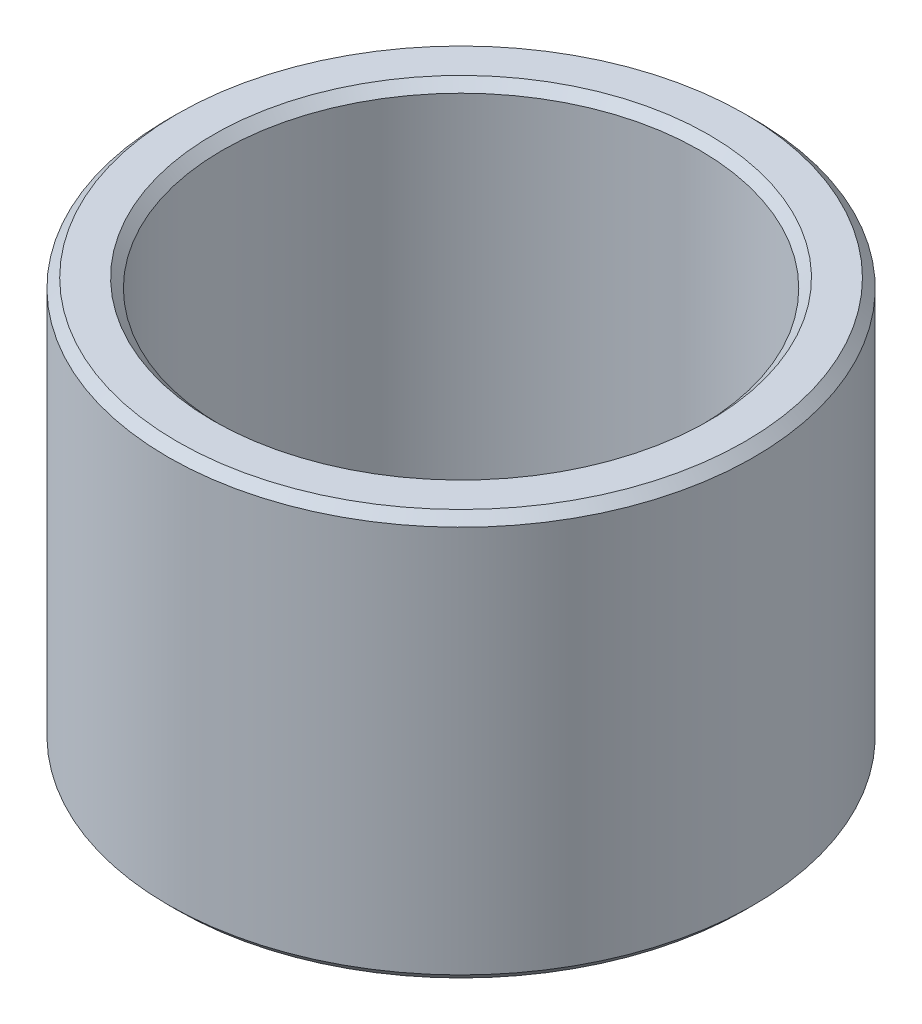
ISO-10303-21;
HEADER;
FILE_DESCRIPTION(('STEP AP214'),'2;1');
FILE_NAME('part.step','',(''),(''),'','','');
FILE_SCHEMA(('AUTOMOTIVE_DESIGN { 1 0 10303 214 1 1 1 1 }'));
ENDSEC;
DATA;
#1=APPLICATION_CONTEXT('core data for automotive mechanical design processes');
#2=APPLICATION_PROTOCOL_DEFINITION('international standard','automotive_design',2000,#1);
#3=PRODUCT_CONTEXT('',#1,'mechanical');
#4=PRODUCT('Part','Part','',(#3));
#5=PRODUCT_RELATED_PRODUCT_CATEGORY('part','',(#4));
#6=PRODUCT_DEFINITION_FORMATION('','',#4);
#7=PRODUCT_DEFINITION_CONTEXT('part definition',#1,'design');
#8=PRODUCT_DEFINITION('design','',#6,#7);
#9=PRODUCT_DEFINITION_SHAPE('','',#8);
#10=(LENGTH_UNIT() NAMED_UNIT(*) SI_UNIT(.MILLI.,.METRE.));
#11=(NAMED_UNIT(*) PLANE_ANGLE_UNIT() SI_UNIT($,.RADIAN.));
#12=(NAMED_UNIT(*) SI_UNIT($,.STERADIAN.) SOLID_ANGLE_UNIT());
#13=UNCERTAINTY_MEASURE_WITH_UNIT(LENGTH_MEASURE(1.E-05),#10,'distance_accuracy_value','');
#14=(GEOMETRIC_REPRESENTATION_CONTEXT(3) GLOBAL_UNCERTAINTY_ASSIGNED_CONTEXT((#13)) GLOBAL_UNIT_ASSIGNED_CONTEXT((#10,
#11,#12)) REPRESENTATION_CONTEXT('',''));
#15=CARTESIAN_POINT('',(0.,0.,0.));
#16=DIRECTION('',(0.,0.,1.));
#17=DIRECTION('',(1.,0.,0.));
#18=AXIS2_PLACEMENT_3D('',#15,#16,#17);
#19=CARTESIAN_POINT('',(0.,55.4194008479267,0.));
#20=DIRECTION('',(0.,-1.,0.));
#21=DIRECTION('',(0.,0.,-1.));
#22=AXIS2_PLACEMENT_3D('',#19,#20,#21);
#23=CYLINDRICAL_SURFACE('',#22,40.);
#24=CARTESIAN_POINT('',(0.,1.23169464694375,0.));
#25=DIRECTION('',(0.,1.,0.));
#26=DIRECTION('',(0.,0.,1.));
#27=AXIS2_PLACEMENT_3D('',#24,#25,#26);
#28=CIRCLE('',#27,40.);
#29=CARTESIAN_POINT('',(0.,1.23169464694375,40.));
#30=VERTEX_POINT('',#29);
#31=EDGE_CURVE('E10',#30,#30,#28,.T.);
#32=ORIENTED_EDGE('',*,*,#31,.T.);
#33=EDGE_LOOP('',(#32));
#34=FACE_BOUND('',#33,.T.);
#35=CARTESIAN_POINT('',(0.,54.1877062009829,0.));
#36=DIRECTION('',(0.,1.,0.));
#37=DIRECTION('',(0.,0.,1.));
#38=AXIS2_PLACEMENT_3D('',#35,#36,#37);
#39=CIRCLE('',#38,40.);
#40=CARTESIAN_POINT('',(0.,54.1877062009829,40.));
#41=VERTEX_POINT('',#40);
#42=EDGE_CURVE('E50',#41,#41,#39,.F.);
#43=ORIENTED_EDGE('',*,*,#42,.T.);
#44=EDGE_LOOP('',(#43));
#45=FACE_BOUND('',#44,.T.);
#46=ADVANCED_FACE('F39',(#34,#45),#23,.T.);
#47=CARTESIAN_POINT('',(0.,55.4194008479267,0.));
#48=DIRECTION('',(0.,1.,0.));
#49=DIRECTION('',(0.,0.,1.));
#50=AXIS2_PLACEMENT_3D('',#47,#48,#49);
#51=PLANE('',#50);
#52=CARTESIAN_POINT('',(0.,55.4194008479267,0.));
#53=DIRECTION('',(0.,1.,0.));
#54=DIRECTION('',(0.,0.,1.));
#55=AXIS2_PLACEMENT_3D('',#52,#53,#54);
#56=CIRCLE('',#55,33.8482485564176);
#57=CARTESIAN_POINT('',(0.,55.4194008479267,33.8482485564176));
#58=VERTEX_POINT('',#57);
#59=EDGE_CURVE('E58',#58,#58,#56,.F.);
#60=ORIENTED_EDGE('',*,*,#59,.T.);
#61=EDGE_LOOP('',(#60));
#62=FACE_BOUND('',#61,.T.);
#63=CARTESIAN_POINT('',(0.,55.4194008479267,0.));
#64=DIRECTION('',(0.,1.,0.));
#65=DIRECTION('',(0.,0.,1.));
#66=AXIS2_PLACEMENT_3D('',#63,#64,#65);
#67=CIRCLE('',#66,38.7683053530562);
#68=CARTESIAN_POINT('',(0.,55.4194008479267,38.7683053530562));
#69=VERTEX_POINT('',#68);
#70=EDGE_CURVE('E61',#69,#69,#67,.T.);
#71=ORIENTED_EDGE('',*,*,#70,.T.);
#72=EDGE_LOOP('',(#71));
#73=FACE_BOUND('',#72,.T.);
#74=ADVANCED_FACE('F88',(#62,#73),#51,.T.);
#75=CARTESIAN_POINT('',(0.,0.,0.));
#76=DIRECTION('',(0.,1.,0.));
#77=DIRECTION('',(0.,0.,1.));
#78=AXIS2_PLACEMENT_3D('',#75,#76,#77);
#79=PLANE('',#78);
#80=CARTESIAN_POINT('',(0.,0.,0.));
#81=DIRECTION('',(0.,1.,0.));
#82=DIRECTION('',(0.,0.,1.));
#83=AXIS2_PLACEMENT_3D('',#80,#81,#82);
#84=CIRCLE('',#83,33.8482485564176);
#85=CARTESIAN_POINT('',(0.,0.,33.8482485564176));
#86=VERTEX_POINT('',#85);
#87=EDGE_CURVE('E51',#86,#86,#84,.T.);
#88=ORIENTED_EDGE('',*,*,#87,.T.);
#89=EDGE_LOOP('',(#88));
#90=FACE_BOUND('',#89,.T.);
#91=CARTESIAN_POINT('',(0.,0.,0.));
#92=DIRECTION('',(0.,1.,0.));
#93=DIRECTION('',(0.,0.,1.));
#94=AXIS2_PLACEMENT_3D('',#91,#92,#93);
#95=CIRCLE('',#94,38.7683053530563);
#96=CARTESIAN_POINT('',(0.,0.,38.7683053530563));
#97=VERTEX_POINT('',#96);
#98=EDGE_CURVE('E54',#97,#97,#95,.F.);
#99=ORIENTED_EDGE('',*,*,#98,.T.);
#100=EDGE_LOOP('',(#99));
#101=FACE_BOUND('',#100,.T.);
#102=ADVANCED_FACE('F83',(#90,#101),#79,.F.);
#103=CARTESIAN_POINT('',(0.,55.4194008479267,0.));
#104=DIRECTION('',(0.,-1.,0.));
#105=DIRECTION('',(0.,0.,-1.));
#106=AXIS2_PLACEMENT_3D('',#103,#104,#105);
#107=CYLINDRICAL_SURFACE('',#106,32.6165539094738);
#108=CARTESIAN_POINT('',(0.,54.1877062009829,0.));
#109=DIRECTION('',(0.,1.,0.));
#110=DIRECTION('',(0.,0.,1.));
#111=AXIS2_PLACEMENT_3D('',#108,#109,#110);
#112=CIRCLE('',#111,32.6165539094738);
#113=CARTESIAN_POINT('',(0.,54.1877062009829,32.6165539094738));
#114=VERTEX_POINT('',#113);
#115=EDGE_CURVE('E67',#114,#114,#112,.T.);
#116=ORIENTED_EDGE('',*,*,#115,.T.);
#117=EDGE_LOOP('',(#116));
#118=FACE_BOUND('',#117,.T.);
#119=CARTESIAN_POINT('',(0.,1.23169464694378,0.));
#120=DIRECTION('',(0.,1.,0.));
#121=DIRECTION('',(0.,0.,1.));
#122=AXIS2_PLACEMENT_3D('',#119,#120,#121);
#123=CIRCLE('',#122,32.6165539094738);
#124=CARTESIAN_POINT('',(0.,1.23169464694378,32.6165539094738));
#125=VERTEX_POINT('',#124);
#126=EDGE_CURVE('E69',#125,#125,#123,.F.);
#127=ORIENTED_EDGE('',*,*,#126,.T.);
#128=EDGE_LOOP('',(#127));
#129=FACE_BOUND('',#128,.T.);
#130=ADVANCED_FACE('F71',(#118,#129),#107,.F.);
#131=CARTESIAN_POINT('',(0.,54.1877062009829,0.));
#132=DIRECTION('',(0.,1.,0.));
#133=DIRECTION('',(0.,0.,1.));
#134=AXIS2_PLACEMENT_3D('',#131,#132,#133);
#135=CONICAL_SURFACE('',#134,32.6165539094738,0.785398163397457);
#136=ORIENTED_EDGE('',*,*,#59,.F.);
#137=EDGE_LOOP('',(#136));
#138=FACE_BOUND('',#137,.T.);
#139=ORIENTED_EDGE('',*,*,#115,.F.);
#140=EDGE_LOOP('',(#139));
#141=FACE_BOUND('',#140,.T.);
#142=ADVANCED_FACE('F77',(#138,#141),#135,.F.);
#143=CARTESIAN_POINT('',(0.,0.,0.));
#144=DIRECTION('',(0.,-1.,0.));
#145=DIRECTION('',(0.,0.,-1.));
#146=AXIS2_PLACEMENT_3D('',#143,#144,#145);
#147=CONICAL_SURFACE('',#146,33.8482485564176,0.785398163397446);
#148=ORIENTED_EDGE('',*,*,#126,.F.);
#149=EDGE_LOOP('',(#148));
#150=FACE_BOUND('',#149,.T.);
#151=ORIENTED_EDGE('',*,*,#87,.F.);
#152=EDGE_LOOP('',(#151));
#153=FACE_BOUND('',#152,.T.);
#154=ADVANCED_FACE('F73',(#150,#153),#147,.F.);
#155=CARTESIAN_POINT('',(0.,1.23169464694375,0.));
#156=DIRECTION('',(0.,1.,0.));
#157=DIRECTION('',(0.,0.,1.));
#158=AXIS2_PLACEMENT_3D('',#155,#156,#157);
#159=CONICAL_SURFACE('',#158,40.,0.785398163397448);
#160=ORIENTED_EDGE('',*,*,#98,.F.);
#161=EDGE_LOOP('',(#160));
#162=FACE_BOUND('',#161,.T.);
#163=ORIENTED_EDGE('',*,*,#31,.F.);
#164=EDGE_LOOP('',(#163));
#165=FACE_BOUND('',#164,.T.);
#166=ADVANCED_FACE('F76',(#162,#165),#159,.T.);
#167=CARTESIAN_POINT('',(0.,55.4194008479267,0.));
#168=DIRECTION('',(0.,-1.,0.));
#169=DIRECTION('',(0.,0.,-1.));
#170=AXIS2_PLACEMENT_3D('',#167,#168,#169);
#171=CONICAL_SURFACE('',#170,38.7683053530562,0.785398163397451);
#172=ORIENTED_EDGE('',*,*,#42,.F.);
#173=EDGE_LOOP('',(#172));
#174=FACE_BOUND('',#173,.T.);
#175=ORIENTED_EDGE('',*,*,#70,.F.);
#176=EDGE_LOOP('',(#175));
#177=FACE_BOUND('',#176,.T.);
#178=ADVANCED_FACE('F45',(#174,#177),#171,.T.);
#179=CLOSED_SHELL('',(#46,#74,#102,#130,#142,#154,#166,#178));
#180=MANIFOLD_SOLID_BREP('B2',#179);
#181=ADVANCED_BREP_SHAPE_REPRESENTATION('',(#18,#180),#14);
#182=SHAPE_DEFINITION_REPRESENTATION(#9,#181);
ENDSEC;
END-ISO-10303-21;
